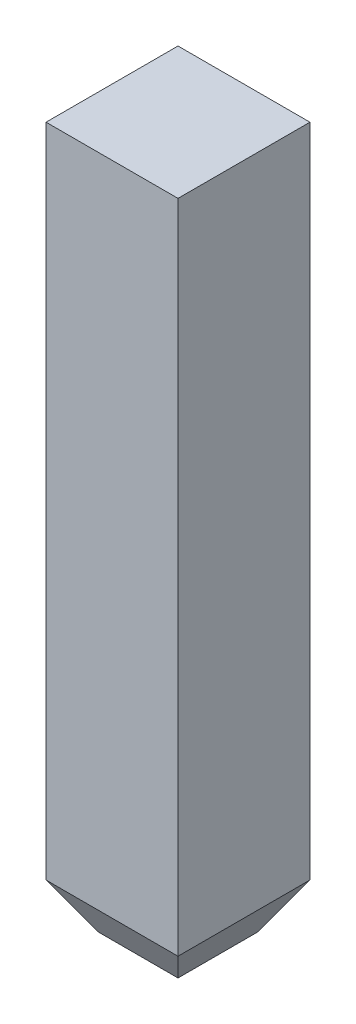
ISO-10303-21;
HEADER;
FILE_DESCRIPTION(('STEP AP214'),'2;1');
FILE_NAME('part.step','',(''),(''),'','','');
FILE_SCHEMA(('AUTOMOTIVE_DESIGN { 1 0 10303 214 1 1 1 1 }'));
ENDSEC;
DATA;
#1=APPLICATION_CONTEXT('core data for automotive mechanical design processes');
#2=APPLICATION_PROTOCOL_DEFINITION('international standard','automotive_design',2000,#1);
#3=PRODUCT_CONTEXT('',#1,'mechanical');
#4=PRODUCT('Part','Part','',(#3));
#5=PRODUCT_RELATED_PRODUCT_CATEGORY('part','',(#4));
#6=PRODUCT_DEFINITION_FORMATION('','',#4);
#7=PRODUCT_DEFINITION_CONTEXT('part definition',#1,'design');
#8=PRODUCT_DEFINITION('design','',#6,#7);
#9=PRODUCT_DEFINITION_SHAPE('','',#8);
#10=(LENGTH_UNIT() NAMED_UNIT(*) SI_UNIT(.MILLI.,.METRE.));
#11=(NAMED_UNIT(*) PLANE_ANGLE_UNIT() SI_UNIT($,.RADIAN.));
#12=(NAMED_UNIT(*) SI_UNIT($,.STERADIAN.) SOLID_ANGLE_UNIT());
#13=UNCERTAINTY_MEASURE_WITH_UNIT(LENGTH_MEASURE(1.E-05),#10,'distance_accuracy_value','');
#14=(GEOMETRIC_REPRESENTATION_CONTEXT(3) GLOBAL_UNCERTAINTY_ASSIGNED_CONTEXT((#13)) GLOBAL_UNIT_ASSIGNED_CONTEXT((#10,
#11,#12)) REPRESENTATION_CONTEXT('',''));
#15=CARTESIAN_POINT('',(0.,0.,0.));
#16=DIRECTION('',(0.,0.,1.));
#17=DIRECTION('',(1.,0.,0.));
#18=AXIS2_PLACEMENT_3D('',#15,#16,#17);
#19=CARTESIAN_POINT('',(-0.929999999999999,-3.4,0.82));
#20=DIRECTION('',(-1.,0.,0.));
#21=DIRECTION('',(0.,0.,1.));
#22=AXIS2_PLACEMENT_3D('',#19,#20,#21);
#23=PLANE('',#22);
#24=DIRECTION('',(0.,1.,0.));
#25=VECTOR('',#24,1.);
#26=CARTESIAN_POINT('',(-0.929999999999999,-3.4,0.82));
#27=LINE('',#26,#25);
#28=CARTESIAN_POINT('',(-0.929999999999999,-3.18349364905389,0.82));
#29=VERTEX_POINT('',#28);
#30=CARTESIAN_POINT('',(-0.929999999999999,0.,0.82));
#31=VERTEX_POINT('',#30);
#32=EDGE_CURVE('E11',#29,#31,#27,.T.);
#33=ORIENTED_EDGE('',*,*,#32,.F.);
#34=DIRECTION('',(0.,0.,-1.));
#35=VECTOR('',#34,1.);
#36=CARTESIAN_POINT('',(-0.929999999999999,-3.18349364905389,0.82));
#37=LINE('',#36,#35);
#38=CARTESIAN_POINT('',(-0.93,-3.18349364905389,0.18));
#39=VERTEX_POINT('',#38);
#40=EDGE_CURVE('E24',#29,#39,#37,.T.);
#41=ORIENTED_EDGE('',*,*,#40,.T.);
#42=DIRECTION('',(0.,1.,0.));
#43=VECTOR('',#42,1.);
#44=CARTESIAN_POINT('',(-0.93,-3.4,0.18));
#45=LINE('',#44,#43);
#46=CARTESIAN_POINT('',(-0.93,0.,0.18));
#47=VERTEX_POINT('',#46);
#48=EDGE_CURVE('E117',#39,#47,#45,.T.);
#49=ORIENTED_EDGE('',*,*,#48,.T.);
#50=DIRECTION('',(0.,0.,1.));
#51=VECTOR('',#50,1.);
#52=CARTESIAN_POINT('',(-0.929999999999999,0.,0.82));
#53=LINE('',#52,#51);
#54=EDGE_CURVE('E115',#47,#31,#53,.T.);
#55=ORIENTED_EDGE('',*,*,#54,.T.);
#56=EDGE_LOOP('',(#33,#41,#49,#55));
#57=FACE_BOUND('',#56,.T.);
#58=ADVANCED_FACE('F17',(#57),#23,.F.);
#59=CARTESIAN_POINT('',(-1.57,-3.4,0.82));
#60=DIRECTION('',(0.,0.,-1.));
#61=DIRECTION('',(-1.,0.,0.));
#62=AXIS2_PLACEMENT_3D('',#59,#60,#61);
#63=PLANE('',#62);
#64=DIRECTION('',(0.,1.,0.));
#65=VECTOR('',#64,1.);
#66=CARTESIAN_POINT('',(-1.57,-3.4,0.82));
#67=LINE('',#66,#65);
#68=CARTESIAN_POINT('',(-1.57,-3.18349364905389,0.82));
#69=VERTEX_POINT('',#68);
#70=CARTESIAN_POINT('',(-1.57,0.,0.82));
#71=VERTEX_POINT('',#70);
#72=EDGE_CURVE('E113',#69,#71,#67,.T.);
#73=ORIENTED_EDGE('',*,*,#72,.F.);
#74=DIRECTION('',(1.,0.,0.));
#75=VECTOR('',#74,1.);
#76=CARTESIAN_POINT('',(-1.57,-3.18349364905389,0.82));
#77=LINE('',#76,#75);
#78=EDGE_CURVE('E111',#69,#29,#77,.T.);
#79=ORIENTED_EDGE('',*,*,#78,.T.);
#80=ORIENTED_EDGE('',*,*,#32,.T.);
#81=DIRECTION('',(-1.,0.,0.));
#82=VECTOR('',#81,1.);
#83=CARTESIAN_POINT('',(-1.57,0.,0.82));
#84=LINE('',#83,#82);
#85=EDGE_CURVE('E109',#31,#71,#84,.T.);
#86=ORIENTED_EDGE('',*,*,#85,.T.);
#87=EDGE_LOOP('',(#73,#79,#80,#86));
#88=FACE_BOUND('',#87,.T.);
#89=ADVANCED_FACE('F139',(#88),#63,.F.);
#90=CARTESIAN_POINT('',(-1.57,-3.4,0.18));
#91=DIRECTION('',(1.,0.,0.));
#92=DIRECTION('',(0.,0.,-1.));
#93=AXIS2_PLACEMENT_3D('',#90,#91,#92);
#94=PLANE('',#93);
#95=DIRECTION('',(0.,1.,0.));
#96=VECTOR('',#95,1.);
#97=CARTESIAN_POINT('',(-1.57,-3.4,0.18));
#98=LINE('',#97,#96);
#99=CARTESIAN_POINT('',(-1.57,-3.18349364905389,0.18));
#100=VERTEX_POINT('',#99);
#101=CARTESIAN_POINT('',(-1.57,0.,0.18));
#102=VERTEX_POINT('',#101);
#103=EDGE_CURVE('E107',#100,#102,#98,.T.);
#104=ORIENTED_EDGE('',*,*,#103,.F.);
#105=DIRECTION('',(0.,0.,1.));
#106=VECTOR('',#105,1.);
#107=CARTESIAN_POINT('',(-1.57,-3.18349364905389,0.18));
#108=LINE('',#107,#106);
#109=EDGE_CURVE('E104',#100,#69,#108,.T.);
#110=ORIENTED_EDGE('',*,*,#109,.T.);
#111=ORIENTED_EDGE('',*,*,#72,.T.);
#112=DIRECTION('',(0.,0.,-1.));
#113=VECTOR('',#112,1.);
#114=CARTESIAN_POINT('',(-1.57,0.,0.18));
#115=LINE('',#114,#113);
#116=EDGE_CURVE('E101',#71,#102,#115,.T.);
#117=ORIENTED_EDGE('',*,*,#116,.T.);
#118=EDGE_LOOP('',(#104,#110,#111,#117));
#119=FACE_BOUND('',#118,.T.);
#120=ADVANCED_FACE('F134',(#119),#94,.F.);
#121=CARTESIAN_POINT('',(-0.93,-3.4,0.18));
#122=DIRECTION('',(0.,0.,1.));
#123=DIRECTION('',(1.,0.,0.));
#124=AXIS2_PLACEMENT_3D('',#121,#122,#123);
#125=PLANE('',#124);
#126=ORIENTED_EDGE('',*,*,#48,.F.);
#127=DIRECTION('',(-1.,0.,0.));
#128=VECTOR('',#127,1.);
#129=CARTESIAN_POINT('',(-0.93,-3.18349364905389,0.18));
#130=LINE('',#129,#128);
#131=EDGE_CURVE('E98',#39,#100,#130,.T.);
#132=ORIENTED_EDGE('',*,*,#131,.T.);
#133=ORIENTED_EDGE('',*,*,#103,.T.);
#134=DIRECTION('',(1.,0.,0.));
#135=VECTOR('',#134,1.);
#136=CARTESIAN_POINT('',(-0.93,0.,0.18));
#137=LINE('',#136,#135);
#138=EDGE_CURVE('E95',#102,#47,#137,.T.);
#139=ORIENTED_EDGE('',*,*,#138,.T.);
#140=EDGE_LOOP('',(#126,#132,#133,#139));
#141=FACE_BOUND('',#140,.T.);
#142=ADVANCED_FACE('F122',(#141),#125,.F.);
#143=CARTESIAN_POINT('',(0.,-3.4,0.));
#144=DIRECTION('',(0.,1.,0.));
#145=DIRECTION('',(0.,0.,1.));
#146=AXIS2_PLACEMENT_3D('',#143,#144,#145);
#147=PLANE('',#146);
#148=DIRECTION('',(0.,0.,-1.));
#149=VECTOR('',#148,1.);
#150=CARTESIAN_POINT('',(-1.445,-3.4,0.));
#151=LINE('',#150,#149);
#152=CARTESIAN_POINT('',(-1.445,-3.4,0.695));
#153=VERTEX_POINT('',#152);
#154=CARTESIAN_POINT('',(-1.445,-3.4,0.305));
#155=VERTEX_POINT('',#154);
#156=EDGE_CURVE('E93',#153,#155,#151,.T.);
#157=ORIENTED_EDGE('',*,*,#156,.T.);
#158=DIRECTION('',(1.,0.,0.));
#159=VECTOR('',#158,1.);
#160=CARTESIAN_POINT('',(0.,-3.4,0.305));
#161=LINE('',#160,#159);
#162=CARTESIAN_POINT('',(-1.055,-3.4,0.305));
#163=VERTEX_POINT('',#162);
#164=EDGE_CURVE('E72',#155,#163,#161,.T.);
#165=ORIENTED_EDGE('',*,*,#164,.T.);
#166=DIRECTION('',(0.,0.,1.));
#167=VECTOR('',#166,1.);
#168=CARTESIAN_POINT('',(-1.055,-3.4,0.));
#169=LINE('',#168,#167);
#170=CARTESIAN_POINT('',(-1.055,-3.4,0.695));
#171=VERTEX_POINT('',#170);
#172=EDGE_CURVE('E66',#163,#171,#169,.T.);
#173=ORIENTED_EDGE('',*,*,#172,.T.);
#174=DIRECTION('',(-1.,0.,0.));
#175=VECTOR('',#174,1.);
#176=CARTESIAN_POINT('',(0.,-3.4,0.695));
#177=LINE('',#176,#175);
#178=EDGE_CURVE('E69',#171,#153,#177,.T.);
#179=ORIENTED_EDGE('',*,*,#178,.T.);
#180=EDGE_LOOP('',(#157,#165,#173,#179));
#181=FACE_BOUND('',#180,.T.);
#182=ADVANCED_FACE('F68',(#181),#147,.F.);
#183=CARTESIAN_POINT('',(0.,0.,0.));
#184=DIRECTION('',(0.,1.,0.));
#185=DIRECTION('',(0.,0.,1.));
#186=AXIS2_PLACEMENT_3D('',#183,#184,#185);
#187=PLANE('',#186);
#188=ORIENTED_EDGE('',*,*,#54,.F.);
#189=ORIENTED_EDGE('',*,*,#138,.F.);
#190=ORIENTED_EDGE('',*,*,#116,.F.);
#191=ORIENTED_EDGE('',*,*,#85,.F.);
#192=EDGE_LOOP('',(#188,#189,#190,#191));
#193=FACE_BOUND('',#192,.T.);
#194=ADVANCED_FACE('F138',(#193),#187,.T.);
#195=CARTESIAN_POINT('',(0.,-3.4,0.695));
#196=DIRECTION('',(0.,0.500000000000001,-0.866025403784438));
#197=DIRECTION('',(-1.,0.,0.));
#198=AXIS2_PLACEMENT_3D('',#195,#196,#197);
#199=PLANE('',#198);
#200=DIRECTION('',(-0.447213595499959,-0.774596669241483,-0.447213595499959));
#201=VECTOR('',#200,1.);
#202=CARTESIAN_POINT('',(-1.194,-3.64075506225208,0.555999999999999));
#203=LINE('',#202,#201);
#204=EDGE_CURVE('E82',#29,#171,#203,.T.);
#205=ORIENTED_EDGE('',*,*,#204,.F.);
#206=ORIENTED_EDGE('',*,*,#78,.F.);
#207=DIRECTION('',(-0.447213595499959,0.774596669241483,0.447213595499959));
#208=VECTOR('',#207,1.);
#209=CARTESIAN_POINT('',(-1.156,-3.90056268338741,0.405999999999999));
#210=LINE('',#209,#208);
#211=EDGE_CURVE('E84',#153,#69,#210,.T.);
#212=ORIENTED_EDGE('',*,*,#211,.F.);
#213=ORIENTED_EDGE('',*,*,#178,.F.);
#214=EDGE_LOOP('',(#205,#206,#212,#213));
#215=FACE_BOUND('',#214,.T.);
#216=ADVANCED_FACE('F80',(#215),#199,.F.);
#217=CARTESIAN_POINT('',(-1.445,-3.4,0.));
#218=DIRECTION('',(0.866025403784438,0.500000000000001,0.));
#219=DIRECTION('',(0.,0.,-1.));
#220=AXIS2_PLACEMENT_3D('',#217,#218,#219);
#221=PLANE('',#220);
#222=ORIENTED_EDGE('',*,*,#211,.T.);
#223=ORIENTED_EDGE('',*,*,#109,.F.);
#224=DIRECTION('',(-0.447213595499959,0.774596669241483,-0.447213595499959));
#225=VECTOR('',#224,1.);
#226=CARTESIAN_POINT('',(-1.506,-3.2943449007383,0.244));
#227=LINE('',#226,#225);
#228=EDGE_CURVE('E88',#155,#100,#227,.T.);
#229=ORIENTED_EDGE('',*,*,#228,.F.);
#230=ORIENTED_EDGE('',*,*,#156,.F.);
#231=EDGE_LOOP('',(#222,#223,#229,#230));
#232=FACE_BOUND('',#231,.T.);
#233=ADVANCED_FACE('F132',(#232),#221,.F.);
#234=CARTESIAN_POINT('',(-1.055,-3.4,0.));
#235=DIRECTION('',(-0.866025403784438,0.500000000000001,0.));
#236=DIRECTION('',(0.,0.,1.));
#237=AXIS2_PLACEMENT_3D('',#234,#235,#236);
#238=PLANE('',#237);
#239=ORIENTED_EDGE('',*,*,#204,.T.);
#240=ORIENTED_EDGE('',*,*,#172,.F.);
#241=DIRECTION('',(-0.447213595499958,-0.774596669241483,0.447213595499959));
#242=VECTOR('',#241,1.);
#243=CARTESIAN_POINT('',(-0.994000000000001,-3.2943449007383,0.244));
#244=LINE('',#243,#242);
#245=EDGE_CURVE('E127',#39,#163,#244,.T.);
#246=ORIENTED_EDGE('',*,*,#245,.F.);
#247=ORIENTED_EDGE('',*,*,#40,.F.);
#248=EDGE_LOOP('',(#239,#240,#246,#247));
#249=FACE_BOUND('',#248,.T.);
#250=ADVANCED_FACE('F86',(#249),#238,.F.);
#251=CARTESIAN_POINT('',(0.,-3.4,0.305));
#252=DIRECTION('',(0.,0.500000000000001,0.866025403784438));
#253=DIRECTION('',(1.,0.,0.));
#254=AXIS2_PLACEMENT_3D('',#251,#252,#253);
#255=PLANE('',#254);
#256=ORIENTED_EDGE('',*,*,#228,.T.);
#257=ORIENTED_EDGE('',*,*,#131,.F.);
#258=ORIENTED_EDGE('',*,*,#245,.T.);
#259=ORIENTED_EDGE('',*,*,#164,.F.);
#260=EDGE_LOOP('',(#256,#257,#258,#259));
#261=FACE_BOUND('',#260,.T.);
#262=ADVANCED_FACE('F126',(#261),#255,.F.);
#263=CLOSED_SHELL('',(#58,#89,#120,#142,#182,#194,#216,#233,#250,#262));
#264=MANIFOLD_SOLID_BREP('B1',#263);
#265=ADVANCED_BREP_SHAPE_REPRESENTATION('',(#18,#264),#14);
#266=SHAPE_DEFINITION_REPRESENTATION(#9,#265);
ENDSEC;
END-ISO-10303-21;
